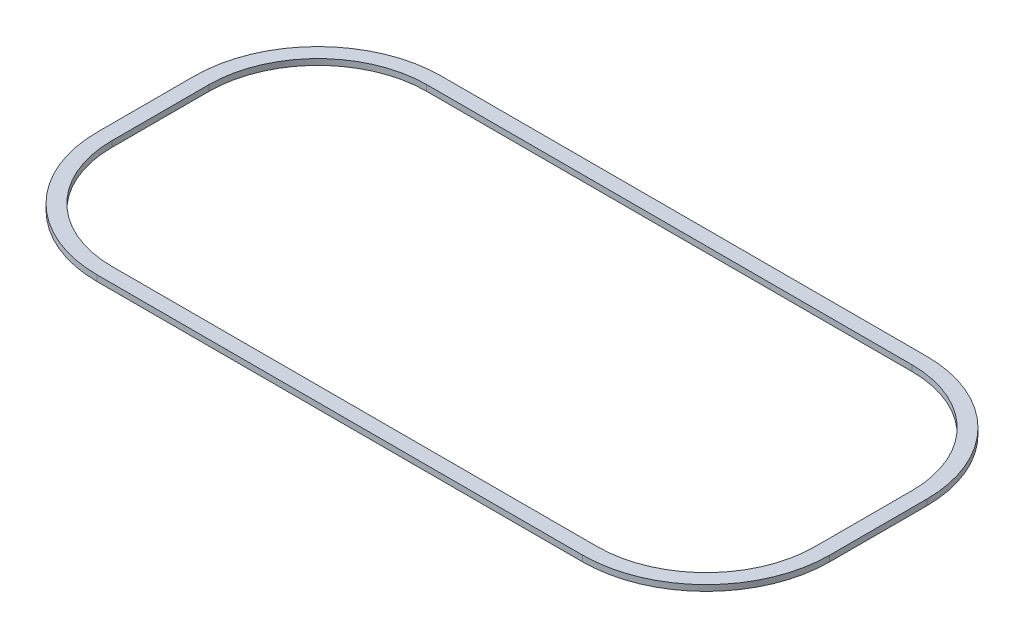
ISO-10303-21;
HEADER;
FILE_DESCRIPTION(('STEP AP214'),'2;1');
FILE_NAME('part.step','',(''),(''),'','','');
FILE_SCHEMA(('AUTOMOTIVE_DESIGN { 1 0 10303 214 1 1 1 1 }'));
ENDSEC;
DATA;
#1=APPLICATION_CONTEXT('core data for automotive mechanical design processes');
#2=APPLICATION_PROTOCOL_DEFINITION('international standard','automotive_design',2000,#1);
#3=PRODUCT_CONTEXT('',#1,'mechanical');
#4=PRODUCT('Part','Part','',(#3));
#5=PRODUCT_RELATED_PRODUCT_CATEGORY('part','',(#4));
#6=PRODUCT_DEFINITION_FORMATION('','',#4);
#7=PRODUCT_DEFINITION_CONTEXT('part definition',#1,'design');
#8=PRODUCT_DEFINITION('design','',#6,#7);
#9=PRODUCT_DEFINITION_SHAPE('','',#8);
#10=(LENGTH_UNIT() NAMED_UNIT(*) SI_UNIT(.MILLI.,.METRE.));
#11=(NAMED_UNIT(*) PLANE_ANGLE_UNIT() SI_UNIT($,.RADIAN.));
#12=(NAMED_UNIT(*) SI_UNIT($,.STERADIAN.) SOLID_ANGLE_UNIT());
#13=UNCERTAINTY_MEASURE_WITH_UNIT(LENGTH_MEASURE(1.E-05),#10,'distance_accuracy_value','');
#14=(GEOMETRIC_REPRESENTATION_CONTEXT(3) GLOBAL_UNCERTAINTY_ASSIGNED_CONTEXT((#13)) GLOBAL_UNIT_ASSIGNED_CONTEXT((#10,
#11,#12)) REPRESENTATION_CONTEXT('',''));
#15=CARTESIAN_POINT('',(0.,0.,0.));
#16=DIRECTION('',(0.,0.,1.));
#17=DIRECTION('',(1.,0.,0.));
#18=AXIS2_PLACEMENT_3D('',#15,#16,#17);
#19=CARTESIAN_POINT('',(0.,1.016,-21.3445877279403));
#20=DIRECTION('',(0.,1.,0.));
#21=DIRECTION('',(0.,0.,1.));
#22=AXIS2_PLACEMENT_3D('',#19,#20,#21);
#23=PLANE('',#22);
#24=CARTESIAN_POINT('',(0.,1.016,-21.3445877279403));
#25=DIRECTION('',(0.,1.,0.));
#26=DIRECTION('',(0.,0.,1.));
#27=AXIS2_PLACEMENT_3D('',#24,#25,#26);
#28=CIRCLE('',#27,21.3445877279403);
#29=CARTESIAN_POINT('',(-21.3445877279403,1.016,-21.3445877279402));
#30=VERTEX_POINT('',#29);
#31=CARTESIAN_POINT('',(0.,1.016,0.));
#32=VERTEX_POINT('',#31);
#33=EDGE_CURVE('E211',#30,#32,#28,.T.);
#34=ORIENTED_EDGE('',*,*,#33,.T.);
#35=DIRECTION('',(1.,0.,0.));
#36=VECTOR('',#35,1.);
#37=CARTESIAN_POINT('',(0.,1.016,0.));
#38=LINE('',#37,#36);
#39=CARTESIAN_POINT('',(83.82,1.016,0.));
#40=VERTEX_POINT('',#39);
#41=EDGE_CURVE('E214',#32,#40,#38,.T.);
#42=ORIENTED_EDGE('',*,*,#41,.T.);
#43=CARTESIAN_POINT('',(83.82,1.016,-21.3445877279403));
#44=DIRECTION('',(0.,1.,0.));
#45=DIRECTION('',(0.,0.,1.));
#46=AXIS2_PLACEMENT_3D('',#43,#44,#45);
#47=CIRCLE('',#46,21.3445877279403);
#48=CARTESIAN_POINT('',(105.16458772794,1.016,-21.3445877279403));
#49=VERTEX_POINT('',#48);
#50=EDGE_CURVE('E217',#40,#49,#47,.T.);
#51=ORIENTED_EDGE('',*,*,#50,.T.);
#52=DIRECTION('',(0.,0.,-1.));
#53=VECTOR('',#52,1.);
#54=CARTESIAN_POINT('',(105.16458772794,1.016,-21.3445877279403));
#55=LINE('',#54,#53);
#56=CARTESIAN_POINT('',(105.16458772794,1.016,-38.1085877279403));
#57=VERTEX_POINT('',#56);
#58=EDGE_CURVE('E219',#49,#57,#55,.T.);
#59=ORIENTED_EDGE('',*,*,#58,.T.);
#60=CARTESIAN_POINT('',(83.82,1.016,-38.1085877279403));
#61=DIRECTION('',(0.,1.,0.));
#62=DIRECTION('',(0.,0.,1.));
#63=AXIS2_PLACEMENT_3D('',#60,#61,#62);
#64=CIRCLE('',#63,21.3445877279403);
#65=CARTESIAN_POINT('',(83.82,1.016,-59.4531754558805));
#66=VERTEX_POINT('',#65);
#67=EDGE_CURVE('E221',#57,#66,#64,.T.);
#68=ORIENTED_EDGE('',*,*,#67,.T.);
#69=DIRECTION('',(-1.,0.,0.));
#70=VECTOR('',#69,1.);
#71=CARTESIAN_POINT('',(83.82,1.016,-59.4531754558805));
#72=LINE('',#71,#70);
#73=CARTESIAN_POINT('',(0.,1.016,-59.4531754558805));
#74=VERTEX_POINT('',#73);
#75=EDGE_CURVE('E223',#66,#74,#72,.T.);
#76=ORIENTED_EDGE('',*,*,#75,.T.);
#77=CARTESIAN_POINT('',(0.,1.016,-38.1085877279402));
#78=DIRECTION('',(0.,1.,0.));
#79=DIRECTION('',(0.,0.,1.));
#80=AXIS2_PLACEMENT_3D('',#77,#78,#79);
#81=CIRCLE('',#80,21.3445877279403);
#82=CARTESIAN_POINT('',(-21.3445877279403,1.016,-38.1085877279403));
#83=VERTEX_POINT('',#82);
#84=EDGE_CURVE('E225',#74,#83,#81,.T.);
#85=ORIENTED_EDGE('',*,*,#84,.T.);
#86=DIRECTION('',(0.,0.,1.));
#87=VECTOR('',#86,1.);
#88=CARTESIAN_POINT('',(-21.3445877279402,1.016,-38.1085877279402));
#89=LINE('',#88,#87);
#90=EDGE_CURVE('E227',#83,#30,#89,.T.);
#91=ORIENTED_EDGE('',*,*,#90,.T.);
#92=EDGE_LOOP('',(#34,#42,#51,#59,#68,#76,#85,#91));
#93=FACE_BOUND('',#92,.T.);
#94=DIRECTION('',(1.,0.,0.));
#95=VECTOR('',#94,1.);
#96=CARTESIAN_POINT('',(0.,1.016,-2.54));
#97=LINE('',#96,#95);
#98=CARTESIAN_POINT('',(0.,1.016,-2.54));
#99=VERTEX_POINT('',#98);
#100=CARTESIAN_POINT('',(83.82,1.016,-2.54));
#101=VERTEX_POINT('',#100);
#102=EDGE_CURVE('E154',#99,#101,#97,.T.);
#103=ORIENTED_EDGE('',*,*,#102,.F.);
#104=CARTESIAN_POINT('',(0.,1.016,-21.3445877279403));
#105=DIRECTION('',(0.,1.,0.));
#106=DIRECTION('',(0.,0.,1.));
#107=AXIS2_PLACEMENT_3D('',#104,#105,#106);
#108=CIRCLE('',#107,18.8045877279402);
#109=CARTESIAN_POINT('',(-18.8045877279402,1.016,-21.3445877279402));
#110=VERTEX_POINT('',#109);
#111=EDGE_CURVE('E146',#110,#99,#108,.T.);
#112=ORIENTED_EDGE('',*,*,#111,.F.);
#113=DIRECTION('',(0.,0.,1.));
#114=VECTOR('',#113,1.);
#115=CARTESIAN_POINT('',(-18.8045877279403,1.016,-38.1085877279403));
#116=LINE('',#115,#114);
#117=CARTESIAN_POINT('',(-18.8045877279403,1.016,-38.1085877279403));
#118=VERTEX_POINT('',#117);
#119=EDGE_CURVE('E179',#118,#110,#116,.T.);
#120=ORIENTED_EDGE('',*,*,#119,.F.);
#121=CARTESIAN_POINT('',(0.,1.016,-38.1085877279402));
#122=DIRECTION('',(0.,1.,0.));
#123=DIRECTION('',(0.,0.,1.));
#124=AXIS2_PLACEMENT_3D('',#121,#122,#123);
#125=CIRCLE('',#124,18.8045877279403);
#126=CARTESIAN_POINT('',(0.,1.016,-56.9131754558805));
#127=VERTEX_POINT('',#126);
#128=EDGE_CURVE('E177',#127,#118,#125,.T.);
#129=ORIENTED_EDGE('',*,*,#128,.F.);
#130=DIRECTION('',(-1.,0.,0.));
#131=VECTOR('',#130,1.);
#132=CARTESIAN_POINT('',(83.82,1.016,-56.9131754558805));
#133=LINE('',#132,#131);
#134=CARTESIAN_POINT('',(83.82,1.016,-56.9131754558806));
#135=VERTEX_POINT('',#134);
#136=EDGE_CURVE('E175',#135,#127,#133,.T.);
#137=ORIENTED_EDGE('',*,*,#136,.F.);
#138=CARTESIAN_POINT('',(83.82,1.016,-38.1085877279403));
#139=DIRECTION('',(0.,1.,0.));
#140=DIRECTION('',(0.,0.,1.));
#141=AXIS2_PLACEMENT_3D('',#138,#139,#140);
#142=CIRCLE('',#141,18.8045877279403);
#143=CARTESIAN_POINT('',(102.62458772794,1.016,-38.1085877279403));
#144=VERTEX_POINT('',#143);
#145=EDGE_CURVE('E173',#144,#135,#142,.T.);
#146=ORIENTED_EDGE('',*,*,#145,.F.);
#147=DIRECTION('',(0.,0.,-1.));
#148=VECTOR('',#147,1.);
#149=CARTESIAN_POINT('',(102.62458772794,1.016,-21.3445877279403));
#150=LINE('',#149,#148);
#151=CARTESIAN_POINT('',(102.62458772794,1.016,-21.3445877279403));
#152=VERTEX_POINT('',#151);
#153=EDGE_CURVE('E169',#152,#144,#150,.T.);
#154=ORIENTED_EDGE('',*,*,#153,.F.);
#155=CARTESIAN_POINT('',(83.82,1.016,-21.3445877279403));
#156=DIRECTION('',(0.,1.,0.));
#157=DIRECTION('',(0.,0.,1.));
#158=AXIS2_PLACEMENT_3D('',#155,#156,#157);
#159=CIRCLE('',#158,18.8045877279403);
#160=EDGE_CURVE('E167',#101,#152,#159,.T.);
#161=ORIENTED_EDGE('',*,*,#160,.F.);
#162=EDGE_LOOP('',(#103,#112,#120,#129,#137,#146,#154,#161));
#163=FACE_BOUND('',#162,.T.);
#164=ADVANCED_FACE('F33',(#93,#163),#23,.T.);
#165=CARTESIAN_POINT('',(0.,0.,-21.3445877279403));
#166=DIRECTION('',(0.,1.,0.));
#167=DIRECTION('',(0.,0.,1.));
#168=AXIS2_PLACEMENT_3D('',#165,#166,#167);
#169=PLANE('',#168);
#170=CARTESIAN_POINT('',(0.,0.,-21.3445877279403));
#171=DIRECTION('',(0.,1.,0.));
#172=DIRECTION('',(0.,0.,1.));
#173=AXIS2_PLACEMENT_3D('',#170,#171,#172);
#174=CIRCLE('',#173,21.3445877279403);
#175=CARTESIAN_POINT('',(-21.3445877279403,0.,-21.3445877279402));
#176=VERTEX_POINT('',#175);
#177=CARTESIAN_POINT('',(0.,0.,0.));
#178=VERTEX_POINT('',#177);
#179=EDGE_CURVE('E162',#176,#178,#174,.T.);
#180=ORIENTED_EDGE('',*,*,#179,.F.);
#181=DIRECTION('',(0.,0.,1.));
#182=VECTOR('',#181,1.);
#183=CARTESIAN_POINT('',(-21.3445877279402,0.,-38.1085877279402));
#184=LINE('',#183,#182);
#185=CARTESIAN_POINT('',(-21.3445877279403,0.,-38.1085877279403));
#186=VERTEX_POINT('',#185);
#187=EDGE_CURVE('E215',#186,#176,#184,.T.);
#188=ORIENTED_EDGE('',*,*,#187,.F.);
#189=CARTESIAN_POINT('',(0.,0.,-38.1085877279402));
#190=DIRECTION('',(0.,1.,0.));
#191=DIRECTION('',(0.,0.,1.));
#192=AXIS2_PLACEMENT_3D('',#189,#190,#191);
#193=CIRCLE('',#192,21.3445877279403);
#194=CARTESIAN_POINT('',(0.,0.,-59.4531754558805));
#195=VERTEX_POINT('',#194);
#196=EDGE_CURVE('E242',#195,#186,#193,.T.);
#197=ORIENTED_EDGE('',*,*,#196,.F.);
#198=DIRECTION('',(-1.,0.,0.));
#199=VECTOR('',#198,1.);
#200=CARTESIAN_POINT('',(83.82,0.,-59.4531754558805));
#201=LINE('',#200,#199);
#202=CARTESIAN_POINT('',(83.82,0.,-59.4531754558805));
#203=VERTEX_POINT('',#202);
#204=EDGE_CURVE('E240',#203,#195,#201,.T.);
#205=ORIENTED_EDGE('',*,*,#204,.F.);
#206=CARTESIAN_POINT('',(83.82,0.,-38.1085877279403));
#207=DIRECTION('',(0.,1.,0.));
#208=DIRECTION('',(0.,0.,1.));
#209=AXIS2_PLACEMENT_3D('',#206,#207,#208);
#210=CIRCLE('',#209,21.3445877279403);
#211=CARTESIAN_POINT('',(105.16458772794,0.,-38.1085877279403));
#212=VERTEX_POINT('',#211);
#213=EDGE_CURVE('E238',#212,#203,#210,.T.);
#214=ORIENTED_EDGE('',*,*,#213,.F.);
#215=DIRECTION('',(0.,0.,-1.));
#216=VECTOR('',#215,1.);
#217=CARTESIAN_POINT('',(105.16458772794,0.,-21.3445877279403));
#218=LINE('',#217,#216);
#219=CARTESIAN_POINT('',(105.16458772794,0.,-21.3445877279403));
#220=VERTEX_POINT('',#219);
#221=EDGE_CURVE('E236',#220,#212,#218,.T.);
#222=ORIENTED_EDGE('',*,*,#221,.F.);
#223=CARTESIAN_POINT('',(83.82,0.,-21.3445877279403));
#224=DIRECTION('',(0.,1.,0.));
#225=DIRECTION('',(0.,0.,1.));
#226=AXIS2_PLACEMENT_3D('',#223,#224,#225);
#227=CIRCLE('',#226,21.3445877279403);
#228=CARTESIAN_POINT('',(83.82,0.,0.));
#229=VERTEX_POINT('',#228);
#230=EDGE_CURVE('E234',#229,#220,#227,.T.);
#231=ORIENTED_EDGE('',*,*,#230,.F.);
#232=DIRECTION('',(1.,0.,0.));
#233=VECTOR('',#232,1.);
#234=CARTESIAN_POINT('',(0.,0.,0.));
#235=LINE('',#234,#233);
#236=EDGE_CURVE('E232',#178,#229,#235,.T.);
#237=ORIENTED_EDGE('',*,*,#236,.F.);
#238=EDGE_LOOP('',(#180,#188,#197,#205,#214,#222,#231,#237));
#239=FACE_BOUND('',#238,.T.);
#240=CARTESIAN_POINT('',(0.,0.,-21.3445877279403));
#241=DIRECTION('',(0.,1.,0.));
#242=DIRECTION('',(0.,0.,1.));
#243=AXIS2_PLACEMENT_3D('',#240,#241,#242);
#244=CIRCLE('',#243,18.8045877279402);
#245=CARTESIAN_POINT('',(-18.8045877279402,0.,-21.3445877279402));
#246=VERTEX_POINT('',#245);
#247=CARTESIAN_POINT('',(0.,0.,-2.54));
#248=VERTEX_POINT('',#247);
#249=EDGE_CURVE('E56',#246,#248,#244,.T.);
#250=ORIENTED_EDGE('',*,*,#249,.T.);
#251=DIRECTION('',(1.,0.,0.));
#252=VECTOR('',#251,1.);
#253=CARTESIAN_POINT('',(0.,0.,-2.54));
#254=LINE('',#253,#252);
#255=CARTESIAN_POINT('',(83.82,0.,-2.54));
#256=VERTEX_POINT('',#255);
#257=EDGE_CURVE('E161',#248,#256,#254,.T.);
#258=ORIENTED_EDGE('',*,*,#257,.T.);
#259=CARTESIAN_POINT('',(83.82,0.,-21.3445877279403));
#260=DIRECTION('',(0.,1.,0.));
#261=DIRECTION('',(0.,0.,1.));
#262=AXIS2_PLACEMENT_3D('',#259,#260,#261);
#263=CIRCLE('',#262,18.8045877279403);
#264=CARTESIAN_POINT('',(102.62458772794,0.,-21.3445877279403));
#265=VERTEX_POINT('',#264);
#266=EDGE_CURVE('E183',#256,#265,#263,.T.);
#267=ORIENTED_EDGE('',*,*,#266,.T.);
#268=DIRECTION('',(0.,0.,-1.));
#269=VECTOR('',#268,1.);
#270=CARTESIAN_POINT('',(102.62458772794,0.,-21.3445877279403));
#271=LINE('',#270,#269);
#272=CARTESIAN_POINT('',(102.62458772794,0.,-38.1085877279403));
#273=VERTEX_POINT('',#272);
#274=EDGE_CURVE('E186',#265,#273,#271,.T.);
#275=ORIENTED_EDGE('',*,*,#274,.T.);
#276=CARTESIAN_POINT('',(83.82,0.,-38.1085877279403));
#277=DIRECTION('',(0.,1.,0.));
#278=DIRECTION('',(0.,0.,1.));
#279=AXIS2_PLACEMENT_3D('',#276,#277,#278);
#280=CIRCLE('',#279,18.8045877279403);
#281=CARTESIAN_POINT('',(83.82,0.,-56.9131754558806));
#282=VERTEX_POINT('',#281);
#283=EDGE_CURVE('E189',#273,#282,#280,.T.);
#284=ORIENTED_EDGE('',*,*,#283,.T.);
#285=DIRECTION('',(-1.,0.,0.));
#286=VECTOR('',#285,1.);
#287=CARTESIAN_POINT('',(83.82,0.,-56.9131754558805));
#288=LINE('',#287,#286);
#289=CARTESIAN_POINT('',(0.,0.,-56.9131754558805));
#290=VERTEX_POINT('',#289);
#291=EDGE_CURVE('E192',#282,#290,#288,.T.);
#292=ORIENTED_EDGE('',*,*,#291,.T.);
#293=CARTESIAN_POINT('',(0.,0.,-38.1085877279402));
#294=DIRECTION('',(0.,1.,0.));
#295=DIRECTION('',(0.,0.,1.));
#296=AXIS2_PLACEMENT_3D('',#293,#294,#295);
#297=CIRCLE('',#296,18.8045877279403);
#298=CARTESIAN_POINT('',(-18.8045877279403,0.,-38.1085877279403));
#299=VERTEX_POINT('',#298);
#300=EDGE_CURVE('E195',#290,#299,#297,.T.);
#301=ORIENTED_EDGE('',*,*,#300,.T.);
#302=DIRECTION('',(0.,0.,1.));
#303=VECTOR('',#302,1.);
#304=CARTESIAN_POINT('',(-18.8045877279403,0.,-38.1085877279403));
#305=LINE('',#304,#303);
#306=EDGE_CURVE('E155',#299,#246,#305,.T.);
#307=ORIENTED_EDGE('',*,*,#306,.T.);
#308=EDGE_LOOP('',(#250,#258,#267,#275,#284,#292,#301,#307));
#309=FACE_BOUND('',#308,.T.);
#310=ADVANCED_FACE('F272',(#239,#309),#169,.F.);
#311=CARTESIAN_POINT('',(0.,1.016,-21.3445877279403));
#312=DIRECTION('',(0.,-1.,0.));
#313=DIRECTION('',(0.,0.,-1.));
#314=AXIS2_PLACEMENT_3D('',#311,#312,#313);
#315=CYLINDRICAL_SURFACE('',#314,21.3445877279403);
#316=ORIENTED_EDGE('',*,*,#179,.T.);
#317=DIRECTION('',(0.,-1.,0.));
#318=VECTOR('',#317,1.);
#319=CARTESIAN_POINT('',(0.,1.016,0.));
#320=LINE('',#319,#318);
#321=EDGE_CURVE('E11',#32,#178,#320,.T.);
#322=ORIENTED_EDGE('',*,*,#321,.F.);
#323=ORIENTED_EDGE('',*,*,#33,.F.);
#324=DIRECTION('',(0.,-1.,0.));
#325=VECTOR('',#324,1.);
#326=CARTESIAN_POINT('',(-21.3445877279403,1.016,-21.3445877279402));
#327=LINE('',#326,#325);
#328=EDGE_CURVE('E229',#30,#176,#327,.T.);
#329=ORIENTED_EDGE('',*,*,#328,.T.);
#330=EDGE_LOOP('',(#316,#322,#323,#329));
#331=FACE_BOUND('',#330,.T.);
#332=ADVANCED_FACE('F35',(#331),#315,.T.);
#333=CARTESIAN_POINT('',(0.,1.016,0.));
#334=DIRECTION('',(0.,0.,-1.));
#335=DIRECTION('',(-1.,0.,0.));
#336=AXIS2_PLACEMENT_3D('',#333,#334,#335);
#337=PLANE('',#336);
#338=ORIENTED_EDGE('',*,*,#236,.T.);
#339=DIRECTION('',(0.,-1.,0.));
#340=VECTOR('',#339,1.);
#341=CARTESIAN_POINT('',(83.82,1.016,0.));
#342=LINE('',#341,#340);
#343=EDGE_CURVE('E41',#40,#229,#342,.T.);
#344=ORIENTED_EDGE('',*,*,#343,.F.);
#345=ORIENTED_EDGE('',*,*,#41,.F.);
#346=ORIENTED_EDGE('',*,*,#321,.T.);
#347=EDGE_LOOP('',(#338,#344,#345,#346));
#348=FACE_BOUND('',#347,.T.);
#349=ADVANCED_FACE('F289',(#348),#337,.F.);
#350=CARTESIAN_POINT('',(83.82,1.016,-21.3445877279403));
#351=DIRECTION('',(0.,-1.,0.));
#352=DIRECTION('',(0.,0.,-1.));
#353=AXIS2_PLACEMENT_3D('',#350,#351,#352);
#354=CYLINDRICAL_SURFACE('',#353,21.3445877279403);
#355=ORIENTED_EDGE('',*,*,#230,.T.);
#356=DIRECTION('',(0.,-1.,0.));
#357=VECTOR('',#356,1.);
#358=CARTESIAN_POINT('',(105.16458772794,1.016,-21.3445877279403));
#359=LINE('',#358,#357);
#360=EDGE_CURVE('E259',#49,#220,#359,.T.);
#361=ORIENTED_EDGE('',*,*,#360,.F.);
#362=ORIENTED_EDGE('',*,*,#50,.F.);
#363=ORIENTED_EDGE('',*,*,#343,.T.);
#364=EDGE_LOOP('',(#355,#361,#362,#363));
#365=FACE_BOUND('',#364,.T.);
#366=ADVANCED_FACE('F266',(#365),#354,.T.);
#367=CARTESIAN_POINT('',(105.16458772794,1.016,-21.3445877279403));
#368=DIRECTION('',(-1.,0.,0.));
#369=DIRECTION('',(0.,0.,1.));
#370=AXIS2_PLACEMENT_3D('',#367,#368,#369);
#371=PLANE('',#370);
#372=ORIENTED_EDGE('',*,*,#221,.T.);
#373=DIRECTION('',(0.,-1.,0.));
#374=VECTOR('',#373,1.);
#375=CARTESIAN_POINT('',(105.16458772794,1.016,-38.1085877279403));
#376=LINE('',#375,#374);
#377=EDGE_CURVE('E256',#57,#212,#376,.T.);
#378=ORIENTED_EDGE('',*,*,#377,.F.);
#379=ORIENTED_EDGE('',*,*,#58,.F.);
#380=ORIENTED_EDGE('',*,*,#360,.T.);
#381=EDGE_LOOP('',(#372,#378,#379,#380));
#382=FACE_BOUND('',#381,.T.);
#383=ADVANCED_FACE('F278',(#382),#371,.F.);
#384=CARTESIAN_POINT('',(83.82,1.016,-38.1085877279403));
#385=DIRECTION('',(0.,-1.,0.));
#386=DIRECTION('',(0.,0.,-1.));
#387=AXIS2_PLACEMENT_3D('',#384,#385,#386);
#388=CYLINDRICAL_SURFACE('',#387,21.3445877279403);
#389=ORIENTED_EDGE('',*,*,#213,.T.);
#390=DIRECTION('',(0.,-1.,0.));
#391=VECTOR('',#390,1.);
#392=CARTESIAN_POINT('',(83.82,1.016,-59.4531754558805));
#393=LINE('',#392,#391);
#394=EDGE_CURVE('E253',#66,#203,#393,.T.);
#395=ORIENTED_EDGE('',*,*,#394,.F.);
#396=ORIENTED_EDGE('',*,*,#67,.F.);
#397=ORIENTED_EDGE('',*,*,#377,.T.);
#398=EDGE_LOOP('',(#389,#395,#396,#397));
#399=FACE_BOUND('',#398,.T.);
#400=ADVANCED_FACE('F282',(#399),#388,.T.);
#401=CARTESIAN_POINT('',(83.82,1.016,-59.4531754558805));
#402=DIRECTION('',(0.,0.,1.));
#403=DIRECTION('',(1.,0.,0.));
#404=AXIS2_PLACEMENT_3D('',#401,#402,#403);
#405=PLANE('',#404);
#406=ORIENTED_EDGE('',*,*,#204,.T.);
#407=DIRECTION('',(0.,-1.,0.));
#408=VECTOR('',#407,1.);
#409=CARTESIAN_POINT('',(0.,1.016,-59.4531754558805));
#410=LINE('',#409,#408);
#411=EDGE_CURVE('E250',#74,#195,#410,.T.);
#412=ORIENTED_EDGE('',*,*,#411,.F.);
#413=ORIENTED_EDGE('',*,*,#75,.F.);
#414=ORIENTED_EDGE('',*,*,#394,.T.);
#415=EDGE_LOOP('',(#406,#412,#413,#414));
#416=FACE_BOUND('',#415,.T.);
#417=ADVANCED_FACE('F302',(#416),#405,.F.);
#418=CARTESIAN_POINT('',(0.,1.016,-38.1085877279402));
#419=DIRECTION('',(0.,-1.,0.));
#420=DIRECTION('',(0.,0.,-1.));
#421=AXIS2_PLACEMENT_3D('',#418,#419,#420);
#422=CYLINDRICAL_SURFACE('',#421,21.3445877279403);
#423=ORIENTED_EDGE('',*,*,#196,.T.);
#424=DIRECTION('',(0.,-1.,0.));
#425=VECTOR('',#424,1.);
#426=CARTESIAN_POINT('',(-21.3445877279403,1.016,-38.1085877279403));
#427=LINE('',#426,#425);
#428=EDGE_CURVE('E247',#83,#186,#427,.T.);
#429=ORIENTED_EDGE('',*,*,#428,.F.);
#430=ORIENTED_EDGE('',*,*,#84,.F.);
#431=ORIENTED_EDGE('',*,*,#411,.T.);
#432=EDGE_LOOP('',(#423,#429,#430,#431));
#433=FACE_BOUND('',#432,.T.);
#434=ADVANCED_FACE('F300',(#433),#422,.T.);
#435=CARTESIAN_POINT('',(-21.3445877279402,1.016,-38.1085877279402));
#436=DIRECTION('',(1.,0.,0.));
#437=DIRECTION('',(0.,0.,-1.));
#438=AXIS2_PLACEMENT_3D('',#435,#436,#437);
#439=PLANE('',#438);
#440=ORIENTED_EDGE('',*,*,#187,.T.);
#441=ORIENTED_EDGE('',*,*,#328,.F.);
#442=ORIENTED_EDGE('',*,*,#90,.F.);
#443=ORIENTED_EDGE('',*,*,#428,.T.);
#444=EDGE_LOOP('',(#440,#441,#442,#443));
#445=FACE_BOUND('',#444,.T.);
#446=ADVANCED_FACE('F295',(#445),#439,.F.);
#447=CARTESIAN_POINT('',(0.,1.016,-21.3445877279403));
#448=DIRECTION('',(0.,-1.,0.));
#449=DIRECTION('',(0.,0.,-1.));
#450=AXIS2_PLACEMENT_3D('',#447,#448,#449);
#451=CYLINDRICAL_SURFACE('',#450,18.8045877279402);
#452=ORIENTED_EDGE('',*,*,#249,.F.);
#453=DIRECTION('',(0.,-1.,0.));
#454=VECTOR('',#453,1.);
#455=CARTESIAN_POINT('',(-18.8045877279402,1.016,-21.3445877279402));
#456=LINE('',#455,#454);
#457=EDGE_CURVE('E150',#110,#246,#456,.T.);
#458=ORIENTED_EDGE('',*,*,#457,.F.);
#459=ORIENTED_EDGE('',*,*,#111,.T.);
#460=DIRECTION('',(0.,-1.,0.));
#461=VECTOR('',#460,1.);
#462=CARTESIAN_POINT('',(0.,1.016,-2.54));
#463=LINE('',#462,#461);
#464=EDGE_CURVE('E149',#99,#248,#463,.T.);
#465=ORIENTED_EDGE('',*,*,#464,.T.);
#466=EDGE_LOOP('',(#452,#458,#459,#465));
#467=FACE_BOUND('',#466,.T.);
#468=ADVANCED_FACE('F148',(#467),#451,.F.);
#469=CARTESIAN_POINT('',(0.,1.016,-2.54));
#470=DIRECTION('',(0.,0.,-1.));
#471=DIRECTION('',(-1.,0.,0.));
#472=AXIS2_PLACEMENT_3D('',#469,#470,#471);
#473=PLANE('',#472);
#474=ORIENTED_EDGE('',*,*,#257,.F.);
#475=ORIENTED_EDGE('',*,*,#464,.F.);
#476=ORIENTED_EDGE('',*,*,#102,.T.);
#477=DIRECTION('',(0.,-1.,0.));
#478=VECTOR('',#477,1.);
#479=CARTESIAN_POINT('',(83.82,1.016,-2.54));
#480=LINE('',#479,#478);
#481=EDGE_CURVE('E163',#101,#256,#480,.T.);
#482=ORIENTED_EDGE('',*,*,#481,.T.);
#483=EDGE_LOOP('',(#474,#475,#476,#482));
#484=FACE_BOUND('',#483,.T.);
#485=ADVANCED_FACE('F158',(#484),#473,.T.);
#486=CARTESIAN_POINT('',(83.82,1.016,-21.3445877279403));
#487=DIRECTION('',(0.,-1.,0.));
#488=DIRECTION('',(0.,0.,-1.));
#489=AXIS2_PLACEMENT_3D('',#486,#487,#488);
#490=CYLINDRICAL_SURFACE('',#489,18.8045877279403);
#491=ORIENTED_EDGE('',*,*,#266,.F.);
#492=ORIENTED_EDGE('',*,*,#481,.F.);
#493=ORIENTED_EDGE('',*,*,#160,.T.);
#494=DIRECTION('',(0.,-1.,0.));
#495=VECTOR('',#494,1.);
#496=CARTESIAN_POINT('',(102.62458772794,1.016,-21.3445877279403));
#497=LINE('',#496,#495);
#498=EDGE_CURVE('E208',#152,#265,#497,.T.);
#499=ORIENTED_EDGE('',*,*,#498,.T.);
#500=EDGE_LOOP('',(#491,#492,#493,#499));
#501=FACE_BOUND('',#500,.T.);
#502=ADVANCED_FACE('F327',(#501),#490,.F.);
#503=CARTESIAN_POINT('',(102.62458772794,1.016,-21.3445877279403));
#504=DIRECTION('',(-1.,0.,0.));
#505=DIRECTION('',(0.,0.,1.));
#506=AXIS2_PLACEMENT_3D('',#503,#504,#505);
#507=PLANE('',#506);
#508=ORIENTED_EDGE('',*,*,#274,.F.);
#509=ORIENTED_EDGE('',*,*,#498,.F.);
#510=ORIENTED_EDGE('',*,*,#153,.T.);
#511=DIRECTION('',(0.,-1.,0.));
#512=VECTOR('',#511,1.);
#513=CARTESIAN_POINT('',(102.62458772794,1.016,-38.1085877279403));
#514=LINE('',#513,#512);
#515=EDGE_CURVE('E206',#144,#273,#514,.T.);
#516=ORIENTED_EDGE('',*,*,#515,.T.);
#517=EDGE_LOOP('',(#508,#509,#510,#516));
#518=FACE_BOUND('',#517,.T.);
#519=ADVANCED_FACE('F331',(#518),#507,.T.);
#520=CARTESIAN_POINT('',(83.82,1.016,-38.1085877279403));
#521=DIRECTION('',(0.,-1.,0.));
#522=DIRECTION('',(0.,0.,-1.));
#523=AXIS2_PLACEMENT_3D('',#520,#521,#522);
#524=CYLINDRICAL_SURFACE('',#523,18.8045877279403);
#525=ORIENTED_EDGE('',*,*,#283,.F.);
#526=ORIENTED_EDGE('',*,*,#515,.F.);
#527=ORIENTED_EDGE('',*,*,#145,.T.);
#528=DIRECTION('',(0.,-1.,0.));
#529=VECTOR('',#528,1.);
#530=CARTESIAN_POINT('',(83.82,1.016,-56.9131754558806));
#531=LINE('',#530,#529);
#532=EDGE_CURVE('E204',#135,#282,#531,.T.);
#533=ORIENTED_EDGE('',*,*,#532,.T.);
#534=EDGE_LOOP('',(#525,#526,#527,#533));
#535=FACE_BOUND('',#534,.T.);
#536=ADVANCED_FACE('F337',(#535),#524,.F.);
#537=CARTESIAN_POINT('',(83.82,1.016,-56.9131754558805));
#538=DIRECTION('',(0.,0.,1.));
#539=DIRECTION('',(1.,0.,0.));
#540=AXIS2_PLACEMENT_3D('',#537,#538,#539);
#541=PLANE('',#540);
#542=ORIENTED_EDGE('',*,*,#291,.F.);
#543=ORIENTED_EDGE('',*,*,#532,.F.);
#544=ORIENTED_EDGE('',*,*,#136,.T.);
#545=DIRECTION('',(0.,-1.,0.));
#546=VECTOR('',#545,1.);
#547=CARTESIAN_POINT('',(0.,1.016,-56.9131754558805));
#548=LINE('',#547,#546);
#549=EDGE_CURVE('E202',#127,#290,#548,.T.);
#550=ORIENTED_EDGE('',*,*,#549,.T.);
#551=EDGE_LOOP('',(#542,#543,#544,#550));
#552=FACE_BOUND('',#551,.T.);
#553=ADVANCED_FACE('F341',(#552),#541,.T.);
#554=CARTESIAN_POINT('',(0.,1.016,-38.1085877279402));
#555=DIRECTION('',(0.,-1.,0.));
#556=DIRECTION('',(0.,0.,-1.));
#557=AXIS2_PLACEMENT_3D('',#554,#555,#556);
#558=CYLINDRICAL_SURFACE('',#557,18.8045877279403);
#559=ORIENTED_EDGE('',*,*,#300,.F.);
#560=ORIENTED_EDGE('',*,*,#549,.F.);
#561=ORIENTED_EDGE('',*,*,#128,.T.);
#562=DIRECTION('',(0.,-1.,0.));
#563=VECTOR('',#562,1.);
#564=CARTESIAN_POINT('',(-18.8045877279403,1.016,-38.1085877279403));
#565=LINE('',#564,#563);
#566=EDGE_CURVE('E48',#118,#299,#565,.T.);
#567=ORIENTED_EDGE('',*,*,#566,.T.);
#568=EDGE_LOOP('',(#559,#560,#561,#567));
#569=FACE_BOUND('',#568,.T.);
#570=ADVANCED_FACE('F345',(#569),#558,.F.);
#571=CARTESIAN_POINT('',(-18.8045877279403,1.016,-38.1085877279403));
#572=DIRECTION('',(1.,0.,0.));
#573=DIRECTION('',(0.,0.,-1.));
#574=AXIS2_PLACEMENT_3D('',#571,#572,#573);
#575=PLANE('',#574);
#576=ORIENTED_EDGE('',*,*,#306,.F.);
#577=ORIENTED_EDGE('',*,*,#566,.F.);
#578=ORIENTED_EDGE('',*,*,#119,.T.);
#579=ORIENTED_EDGE('',*,*,#457,.T.);
#580=EDGE_LOOP('',(#576,#577,#578,#579));
#581=FACE_BOUND('',#580,.T.);
#582=ADVANCED_FACE('F349',(#581),#575,.T.);
#583=CLOSED_SHELL('',(#164,#310,#332,#349,#366,#383,#400,#417,#434,#446,#468,#485,#502,#519,
#536,#553,#570,#582));
#584=MANIFOLD_SOLID_BREP('B2',#583);
#585=ADVANCED_BREP_SHAPE_REPRESENTATION('',(#18,#584),#14);
#586=SHAPE_DEFINITION_REPRESENTATION(#9,#585);
ENDSEC;
END-ISO-10303-21;
